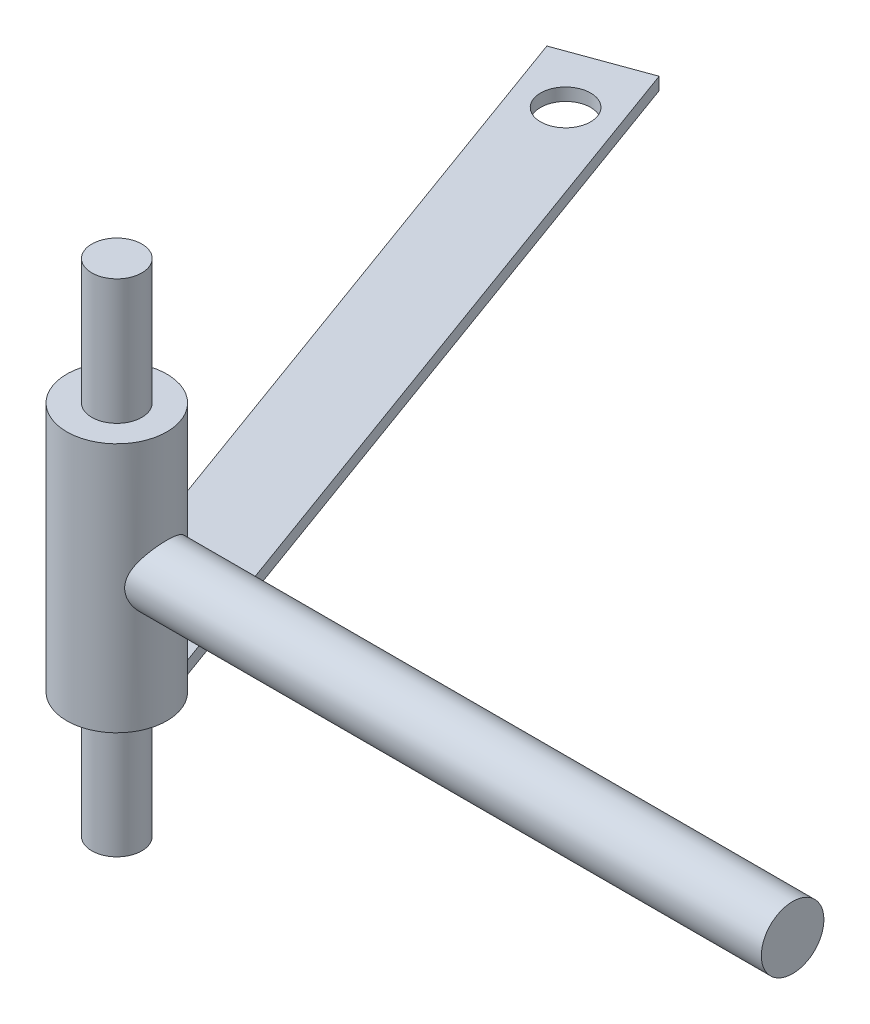
ISO-10303-21;
HEADER;
FILE_DESCRIPTION(('STEP AP214'),'2;1');
FILE_NAME('part.step','',(''),(''),'','','');
FILE_SCHEMA(('AUTOMOTIVE_DESIGN { 1 0 10303 214 1 1 1 1 }'));
ENDSEC;
DATA;
#1=APPLICATION_CONTEXT('core data for automotive mechanical design processes');
#2=APPLICATION_PROTOCOL_DEFINITION('international standard','automotive_design',2000,#1);
#3=PRODUCT_CONTEXT('',#1,'mechanical');
#4=PRODUCT('Part','Part','',(#3));
#5=PRODUCT_RELATED_PRODUCT_CATEGORY('part','',(#4));
#6=PRODUCT_DEFINITION_FORMATION('','',#4);
#7=PRODUCT_DEFINITION_CONTEXT('part definition',#1,'design');
#8=PRODUCT_DEFINITION('design','',#6,#7);
#9=PRODUCT_DEFINITION_SHAPE('','',#8);
#10=(LENGTH_UNIT() NAMED_UNIT(*) SI_UNIT(.MILLI.,.METRE.));
#11=(NAMED_UNIT(*) PLANE_ANGLE_UNIT() SI_UNIT($,.RADIAN.));
#12=(NAMED_UNIT(*) SI_UNIT($,.STERADIAN.) SOLID_ANGLE_UNIT());
#13=UNCERTAINTY_MEASURE_WITH_UNIT(LENGTH_MEASURE(1.E-05),#10,'distance_accuracy_value','');
#14=(GEOMETRIC_REPRESENTATION_CONTEXT(3) GLOBAL_UNCERTAINTY_ASSIGNED_CONTEXT((#13)) GLOBAL_UNIT_ASSIGNED_CONTEXT((#10,
#11,#12)) REPRESENTATION_CONTEXT('',''));
#15=CARTESIAN_POINT('',(0.,0.,0.));
#16=DIRECTION('',(0.,0.,1.));
#17=DIRECTION('',(1.,0.,0.));
#18=AXIS2_PLACEMENT_3D('',#15,#16,#17);
#19=CARTESIAN_POINT('',(0.,20.,0.));
#20=DIRECTION('',(0.,-1.,0.));
#21=DIRECTION('',(0.,0.,-1.));
#22=AXIS2_PLACEMENT_3D('',#19,#20,#21);
#23=CYLINDRICAL_SURFACE('',#22,8.);
#24=CARTESIAN_POINT('',(0.,-18.,0.));
#25=DIRECTION('',(0.,-1.,0.));
#26=DIRECTION('',(0.,0.,-1.));
#27=AXIS2_PLACEMENT_3D('',#24,#25,#26);
#28=CIRCLE('',#27,8.);
#29=CARTESIAN_POINT('',(-7.90248666466915,-18.,-1.24527286757814));
#30=VERTEX_POINT('',#29);
#31=CARTESIAN_POINT('',(5.25321002633356,-18.,-6.03355487413751));
#32=VERTEX_POINT('',#31);
#33=EDGE_CURVE('E52',#30,#32,#28,.T.);
#34=ORIENTED_EDGE('',*,*,#33,.T.);
#35=DIRECTION('',(0.,-1.,0.));
#36=VECTOR('',#35,1.);
#37=CARTESIAN_POINT('',(5.25321002633356,20.,-6.03355487413751));
#38=LINE('',#37,#36);
#39=CARTESIAN_POINT('',(5.25321002633356,-16.,-6.03355487413751));
#40=VERTEX_POINT('',#39);
#41=EDGE_CURVE('E11',#32,#40,#38,.F.);
#42=ORIENTED_EDGE('',*,*,#41,.T.);
#43=CARTESIAN_POINT('',(0.,-16.,0.));
#44=DIRECTION('',(0.,1.,0.));
#45=DIRECTION('',(-1.,0.,0.));
#46=AXIS2_PLACEMENT_3D('',#43,#44,#45);
#47=CIRCLE('',#46,8.);
#48=CARTESIAN_POINT('',(-7.90248666466915,-16.,-1.24527286757812));
#49=VERTEX_POINT('',#48);
#50=EDGE_CURVE('E86',#40,#49,#47,.T.);
#51=ORIENTED_EDGE('',*,*,#50,.T.);
#52=DIRECTION('',(0.,-1.,0.));
#53=VECTOR('',#52,1.);
#54=CARTESIAN_POINT('',(-7.90248666466915,20.,-1.24527286757812));
#55=LINE('',#54,#53);
#56=EDGE_CURVE('E204',#49,#30,#55,.T.);
#57=ORIENTED_EDGE('',*,*,#56,.T.);
#58=EDGE_LOOP('',(#34,#42,#51,#57));
#59=FACE_BOUND('',#58,.T.);
#60=CARTESIAN_POINT('',(0.,20.,0.));
#61=DIRECTION('',(0.,1.,0.));
#62=DIRECTION('',(0.,0.,1.));
#63=AXIS2_PLACEMENT_3D('',#60,#61,#62);
#64=CIRCLE('',#63,8.);
#65=CARTESIAN_POINT('',(0.,20.,8.));
#66=VERTEX_POINT('',#65);
#67=EDGE_CURVE('E130',#66,#66,#64,.T.);
#68=ORIENTED_EDGE('',*,*,#67,.F.);
#69=EDGE_LOOP('',(#68));
#70=FACE_BOUND('',#69,.T.);
#71=CARTESIAN_POINT('',(0.,-20.,0.));
#72=DIRECTION('',(0.,1.,0.));
#73=DIRECTION('',(0.,0.,1.));
#74=AXIS2_PLACEMENT_3D('',#71,#72,#73);
#75=CIRCLE('',#74,8.);
#76=CARTESIAN_POINT('',(0.,-20.,8.));
#77=VERTEX_POINT('',#76);
#78=EDGE_CURVE('E129',#77,#77,#75,.T.);
#79=ORIENTED_EDGE('',*,*,#78,.T.);
#80=EDGE_LOOP('',(#79));
#81=FACE_BOUND('',#80,.T.);
#82=CARTESIAN_POINT('',(6.2449979983984,0.,5.));
#83=CARTESIAN_POINT('',(6.24499999083318,-0.124309997084916,4.99999874728376));
#84=CARTESIAN_POINT('',(6.24872594235153,-0.248643911922182,4.99535477639502));
#85=CARTESIAN_POINT('',(6.26346233698878,-0.49624234521784,4.97686385741702));
#86=CARTESIAN_POINT('',(6.27447707053879,-0.619506190474289,4.96301148892208));
#87=CARTESIAN_POINT('',(6.30332817855701,-0.864132894108489,4.92631685582622));
#88=CARTESIAN_POINT('',(6.32117831167981,-0.985491401070756,4.90345645667282));
#89=CARTESIAN_POINT('',(6.36295500797281,-1.22521846002732,4.84912073775945));
#90=CARTESIAN_POINT('',(6.38688460836052,-1.34358548492504,4.81764111134031));
#91=CARTESIAN_POINT('',(6.46598710467671,-1.69098285176997,4.7115563432738));
#92=CARTESIAN_POINT('',(6.52878844336903,-1.91472159134201,4.6249307188155));
#93=CARTESIAN_POINT('',(6.66732308206754,-2.34407629105235,4.42286683667302));
#94=CARTESIAN_POINT('',(6.74305673480881,-2.54969175663766,4.30742779304936));
#95=CARTESIAN_POINT('',(6.91118002626909,-2.9674414130167,4.03296948836377));
#96=CARTESIAN_POINT('',(7.00444112628932,-3.17674952950574,3.87018134056582));
#97=CARTESIAN_POINT('',(7.19012524520994,-3.5675602565304,3.51319765959103));
#98=CARTESIAN_POINT('',(7.28254746874407,-3.74903864049325,3.31897506071619));
#99=CARTESIAN_POINT('',(7.41988971846401,-4.00760626149244,2.99356128179164));
#100=CARTESIAN_POINT('',(7.46785190700925,-4.09554829341698,2.87212880091628));
#101=CARTESIAN_POINT('',(7.55971876275306,-4.2607595171728,2.62078661715024));
#102=CARTESIAN_POINT('',(7.60362512973126,-4.33803318685166,2.49088050482952));
#103=CARTESIAN_POINT('',(7.68611478127736,-4.48104536831486,2.22333771815377));
#104=CARTESIAN_POINT('',(7.72470066932016,-4.54678952615798,2.08570487145723));
#105=CARTESIAN_POINT('',(7.79539753077303,-4.66588913640084,1.80358193532003));
#106=CARTESIAN_POINT('',(7.82750968154027,-4.71924684175159,1.6590930986712));
#107=CARTESIAN_POINT('',(7.88132879110577,-4.8079574186921,1.37943032429723));
#108=CARTESIAN_POINT('',(7.90376135583819,-4.84458864196752,1.24480106420069));
#109=CARTESIAN_POINT('',(7.94191844310852,-4.90659427549434,0.972050692903698));
#110=CARTESIAN_POINT('',(7.95764407963578,-4.93197055516711,0.833930165626438));
#111=CARTESIAN_POINT('',(7.98191012055643,-4.97102838824165,0.555534462309618));
#112=CARTESIAN_POINT('',(7.9904564434862,-4.98471957483722,0.415261158337185));
#113=CARTESIAN_POINT('',(8.00011955525847,-5.00019508535282,0.133810084943768));
#114=CARTESIAN_POINT('',(8.00123719925945,-5.00198077978344,-0.00736757849820934));
#115=CARTESIAN_POINT('',(7.99636544353032,-4.99418306842006,-0.270239609899376));
#116=CARTESIAN_POINT('',(7.99131217584322,-4.9860972278415,-0.391999310072934));
#117=CARTESIAN_POINT('',(7.97573898833036,-4.96109950689231,-0.63429359230614));
#118=CARTESIAN_POINT('',(7.96521743178982,-4.94418498400023,-0.754827796543429));
#119=CARTESIAN_POINT('',(7.93894787928476,-4.90175195667388,-0.9937504162903));
#120=CARTESIAN_POINT('',(7.92320165200919,-4.8762363638823,-1.11213954368103));
#121=CARTESIAN_POINT('',(7.88683283084566,-4.81691536004192,-1.34607315554106));
#122=CARTESIAN_POINT('',(7.86620835217571,-4.78310674467799,-1.46161652141072));
#123=CARTESIAN_POINT('',(7.79753837345255,-4.66961406787293,-1.80341623892686));
#124=CARTESIAN_POINT('',(7.74273886956257,-4.57793007291278,-2.02447250488061));
#125=CARTESIAN_POINT('',(7.6194209119633,-4.36611560771666,-2.44811588786114));
#126=CARTESIAN_POINT('',(7.55089933332867,-4.24597865675437,-2.6506987826293));
#127=CARTESIAN_POINT('',(7.39573414184525,-3.96389668023518,-3.05883635403528));
#128=CARTESIAN_POINT('',(7.30789649394851,-3.79860933546551,-3.26162345770391));
#129=CARTESIAN_POINT('',(7.12780216070677,-3.43944259665051,-3.63842034253163));
#130=CARTESIAN_POINT('',(7.0355391870356,-3.24552165003414,-3.81238750882611));
#131=CARTESIAN_POINT('',(6.89398778931581,-2.92199806035766,-4.05999923159469));
#132=CARTESIAN_POINT('',(6.84343529038729,-2.80103153254676,-4.14440430037547));
#133=CARTESIAN_POINT('',(6.7450499014227,-2.5512511400869,-4.30267035241461));
#134=CARTESIAN_POINT('',(6.69721752335299,-2.42243580756731,-4.37652935467605));
#135=CARTESIAN_POINT('',(6.60608014442446,-2.15770926568204,-4.51291782494085));
#136=CARTESIAN_POINT('',(6.56276754252838,-2.02181056536115,-4.57546644816391));
#137=CARTESIAN_POINT('',(6.48238923774268,-1.74330768244433,-4.6886516739402));
#138=CARTESIAN_POINT('',(6.44532349757936,-1.60070353986484,-4.7392883475702));
#139=CARTESIAN_POINT('',(6.3879911088914,-1.34808415551627,-4.81614194168603));
#140=CARTESIAN_POINT('',(6.36587062744548,-1.23937010533179,-4.84527833481626));
#141=CARTESIAN_POINT('',(6.3267200135842,-1.01935900201234,-4.89628944573215));
#142=CARTESIAN_POINT('',(6.30968872571675,-0.908062541381968,-4.91816581196151));
#143=CARTESIAN_POINT('',(6.2813224765214,-0.683654493148006,-4.95434333722363));
#144=CARTESIAN_POINT('',(6.26998098512218,-0.570545140796211,-4.96865318123363));
#145=CARTESIAN_POINT('',(6.25339132178237,-0.343158274667134,-4.98951663397229));
#146=CARTESIAN_POINT('',(6.24814339794355,-0.228880713516906,-4.99606992689043));
#147=CARTESIAN_POINT('',(6.24394563972607,0.000213756327469843,-5.00131530513999));
#148=CARTESIAN_POINT('',(6.2450091194138,0.115031294285455,-4.99999077198392));
#149=CARTESIAN_POINT('',(6.25342323341975,0.34411058983996,-4.98946310366481));
#150=CARTESIAN_POINT('',(6.26077617711313,0.458372127783275,-4.98025707456074));
#151=CARTESIAN_POINT('',(6.28148941326477,0.685492435641885,-4.95410620951325));
#152=CARTESIAN_POINT('',(6.29485173090555,0.798350719467862,-4.9371587646522));
#153=CARTESIAN_POINT('',(6.32708655414446,1.02190368194708,-4.8957794498311));
#154=CARTESIAN_POINT('',(6.3459613393153,1.13259744525952,-4.87134448334739));
#155=CARTESIAN_POINT('',(6.40919739263554,1.45674114316006,-4.78821642821574));
#156=CARTESIAN_POINT('',(6.46057720915498,1.6662777271024,-4.71921780239627));
#157=CARTESIAN_POINT('',(6.57662484324882,2.07118631830434,-4.55609149726001));
#158=CARTESIAN_POINT('',(6.6412973751829,2.26655326684989,-4.46195489902188));
#159=CARTESIAN_POINT('',(6.79148506979738,2.67720575477837,-4.23062377482239));
#160=CARTESIAN_POINT('',(6.87862419429458,2.88920195195314,-4.08864375810928));
#161=CARTESIAN_POINT('',(7.05576916354209,3.28876845285956,-3.77473221644168));
#162=CARTESIAN_POINT('',(7.14577790264,3.47631305761312,-3.60276961587649));
#163=CARTESIAN_POINT('',(7.28444679190235,3.75109437385404,-3.30924585333197));
#164=CARTESIAN_POINT('',(7.3346230901993,3.84742308399405,-3.19677534649598));
#165=CARTESIAN_POINT('',(7.43214539316412,4.03023211498251,-2.96297696798608));
#166=CARTESIAN_POINT('',(7.47949245970999,4.11671614194503,-2.84165245789285));
#167=CARTESIAN_POINT('',(7.57009743381039,4.27912544276188,-2.59064393379972));
#168=CARTESIAN_POINT('',(7.61335451021155,4.35504857193848,-2.46095822963468));
#169=CARTESIAN_POINT('',(7.69452475176042,4.49544110368957,-2.19402109584822));
#170=CARTESIAN_POINT('',(7.73244126265916,4.55991768393769,-2.05677447863483));
#171=CARTESIAN_POINT('',(7.79976180045409,4.67313922374355,-1.78389488579443));
#172=CARTESIAN_POINT('',(7.82953658856128,4.72258893611767,-1.64864631402092));
#173=CARTESIAN_POINT('',(7.88249738910155,4.80988250173737,-1.37327166975237));
#174=CARTESIAN_POINT('',(7.90568721484267,4.84773307297854,-1.2331484731144));
#175=CARTESIAN_POINT('',(7.94476970960063,4.91121075887916,-0.949284871547718));
#176=CARTESIAN_POINT('',(7.96066874338032,4.93684853590452,-0.805547737630325));
#177=CARTESIAN_POINT('',(7.98468098207153,4.97547600812264,-0.515747890604359));
#178=CARTESIAN_POINT('',(7.99279547496114,4.98846779564148,-0.369685566273095));
#179=CARTESIAN_POINT('',(8.00036899836203,5.0005918204771,-0.0984542398463481));
#180=CARTESIAN_POINT('',(8.00093085905799,5.00148999709849,0.0266091901107878));
#181=CARTESIAN_POINT('',(7.99619997327325,4.99391869226614,0.276384426548502));
#182=CARTESIAN_POINT('',(7.99090543949389,4.98544635104714,0.401096114033592));
#183=CARTESIAN_POINT('',(7.97459103015405,4.95925462589747,0.649105048465708));
#184=CARTESIAN_POINT('',(7.96357367253312,4.9415393086947,0.772402893113274));
#185=CARTESIAN_POINT('',(7.93607401526798,4.89709863543925,1.01678782002796));
#186=CARTESIAN_POINT('',(7.91958960822669,4.87036980485838,1.13787403075122));
#187=CARTESIAN_POINT('',(7.88220417715129,4.80933512611737,1.3727696067634));
#188=CARTESIAN_POINT('',(7.86147899328625,4.77532902296419,1.486685097437));
#189=CARTESIAN_POINT('',(7.8157172820285,4.69961071566991,1.71105112688166));
#190=CARTESIAN_POINT('',(7.79067928081094,4.65789587685613,1.82150046585626));
#191=CARTESIAN_POINT('',(7.70981708144695,4.52179700785277,2.14674322952902));
#192=CARTESIAN_POINT('',(7.64821482975006,4.41641101660221,2.3556119089249));
#193=CARTESIAN_POINT('',(7.50700801995937,4.1673460340312,2.77466231937412));
#194=CARTESIAN_POINT('',(7.42619858107808,4.02082779517783,2.98273013480178));
#195=CARTESIAN_POINT('',(7.2573471375721,3.6996977630728,3.37285679634255));
#196=CARTESIAN_POINT('',(7.16929702745266,3.52505426989102,3.55488585185797));
#197=CARTESIAN_POINT('',(6.98001614835192,3.12352869133323,3.91489797533942));
#198=CARTESIAN_POINT('',(6.87871489286988,2.89274538552561,4.08851588919805));
#199=CARTESIAN_POINT('',(6.68699282488335,2.40144255795418,4.3950903074783));
#200=CARTESIAN_POINT('',(6.59656601160477,2.14093959230367,4.52806930044201));
#201=CARTESIAN_POINT('',(6.45719150743099,1.65432760274299,4.72397005512007));
#202=CARTESIAN_POINT('',(6.40349524541685,1.43325185965496,4.79586701428079));
#203=CARTESIAN_POINT('',(6.33898756748728,1.09324362690463,4.88041603953431));
#204=CARTESIAN_POINT('',(6.32016868842665,0.978627920072953,4.90470355408434));
#205=CARTESIAN_POINT('',(6.28849738412123,0.747193668970045,4.94524770814465));
#206=CARTESIAN_POINT('',(6.27564188891545,0.630376290428755,4.9615084801139));
#207=CARTESIAN_POINT('',(6.25906589814134,0.427895086979101,4.9823903295282));
#208=CARTESIAN_POINT('',(6.25380210027526,0.342553322442731,4.98898701036639));
#209=CARTESIAN_POINT('',(6.24676702410079,0.171478227136942,4.99779282932784));
#210=CARTESIAN_POINT('',(6.24499662408473,0.0857448033275004,5.00000086408101));
#211=CARTESIAN_POINT('',(6.2449979983984,0.,5.));
#212=B_SPLINE_CURVE_WITH_KNOTS('',3,(#82,#83,#84,#85,#86,#87,#88,#89,#90,#91,#92,#93,#94,#95,
#96,#97,#98,#99,#100,#101,#102,#103,#104,#105,#106,#107,#108,#109,#110,#111,#112,#113,#114,#115,
#116,#117,#118,#119,#120,#121,#122,#123,#124,#125,#126,#127,#128,#129,#130,#131,#132,#133,#134,
#135,#136,#137,#138,#139,#140,#141,#142,#143,#144,#145,#146,#147,#148,#149,#150,#151,#152,#153,
#154,#155,#156,#157,#158,#159,#160,#161,#162,#163,#164,#165,#166,#167,#168,#169,#170,#171,#172,
#173,#174,#175,#176,#177,#178,#179,#180,#181,#182,#183,#184,#185,#186,#187,#188,#189,#190,#191,
#192,#193,#194,#195,#196,#197,#198,#199,#200,#201,#202,#203,#204,#205,#206,#207,#208,#209,#210,
#211),.UNSPECIFIED.,.T.,.F.,(4,2,2,2,2,2,2,2,2,2,2,2,2,2,2,2,2,2,2,2,2,2,2,2,2,2,2,2,2,2,2,2,2,
2,2,2,2,2,2,2,2,2,2,2,2,2,2,2,2,2,2,2,2,2,2,2,2,2,2,2,2,2,2,2,4),(0.,0.372830631717394,
0.745880919988992,1.11968608457865,1.49367836553752,2.2343739724708,2.97508978546025,
3.81517657771247,4.65599058786117,5.1276972709508,5.59920535801266,6.0704818965238,
6.54167264805615,6.9650003716167,7.38825775501684,7.8111658669397,8.2340252946041,
8.59998197802636,8.96604825916241,9.33199074341863,9.69807484639391,10.4313641163756,
11.1648205684642,11.9895533165928,12.8154948839412,13.2827866246025,13.7501660272479,
14.2167463086997,14.6833238060682,15.0271003394338,15.3707987622619,15.7141018213498,
16.0574188576537,16.4014603870609,16.7456282964257,17.0899122787371,17.4343388350078,
18.1111129623981,18.7881275281776,19.5940378131019,20.4007884080993,20.8693475683427,
21.337729748067,21.8062069071061,22.2743892571628,22.7148894158782,23.1551339612148,
23.5949934439159,24.0347801378503,24.409509228706,24.7843527137741,25.1590314139736,
25.5338547106938,25.8954875601863,26.2572442370256,26.9801965139639,27.7781872367985,
28.5770837508034,29.4911341692987,30.4046778558642,31.1173375632652,31.472952845656,
31.8283848529182,32.0854860972178,32.3426519723746),.UNSPECIFIED.);
#213=CARTESIAN_POINT('',(6.2449979983984,0.,5.));
#214=VERTEX_POINT('',#213);
#215=EDGE_CURVE('E150',#214,#214,#212,.T.);
#216=ORIENTED_EDGE('',*,*,#215,.F.);
#217=EDGE_LOOP('',(#216));
#218=FACE_BOUND('',#217,.T.);
#219=ADVANCED_FACE('F43',(#59,#70,#81,#218),#23,.T.);
#220=CARTESIAN_POINT('',(0.,40.,0.));
#221=DIRECTION('',(0.,-1.,0.));
#222=DIRECTION('',(0.,0.,-1.));
#223=AXIS2_PLACEMENT_3D('',#220,#221,#222);
#224=CYLINDRICAL_SURFACE('',#223,4.);
#225=CARTESIAN_POINT('',(0.,20.,0.));
#226=DIRECTION('',(0.,1.,0.));
#227=DIRECTION('',(0.,0.,1.));
#228=AXIS2_PLACEMENT_3D('',#225,#226,#227);
#229=CIRCLE('',#228,4.);
#230=CARTESIAN_POINT('',(0.,20.,4.));
#231=VERTEX_POINT('',#230);
#232=EDGE_CURVE('E134',#231,#231,#229,.T.);
#233=ORIENTED_EDGE('',*,*,#232,.T.);
#234=EDGE_LOOP('',(#233));
#235=FACE_BOUND('',#234,.T.);
#236=CARTESIAN_POINT('',(0.,40.,0.));
#237=DIRECTION('',(0.,1.,0.));
#238=DIRECTION('',(0.,0.,1.));
#239=AXIS2_PLACEMENT_3D('',#236,#237,#238);
#240=CIRCLE('',#239,4.);
#241=CARTESIAN_POINT('',(0.,40.,4.));
#242=VERTEX_POINT('',#241);
#243=EDGE_CURVE('E138',#242,#242,#240,.T.);
#244=ORIENTED_EDGE('',*,*,#243,.F.);
#245=EDGE_LOOP('',(#244));
#246=FACE_BOUND('',#245,.T.);
#247=ADVANCED_FACE('F45',(#235,#246),#224,.T.);
#248=CARTESIAN_POINT('',(0.,40.,0.));
#249=DIRECTION('',(0.,1.,0.));
#250=DIRECTION('',(0.,0.,1.));
#251=AXIS2_PLACEMENT_3D('',#248,#249,#250);
#252=PLANE('',#251);
#253=ORIENTED_EDGE('',*,*,#243,.T.);
#254=EDGE_LOOP('',(#253));
#255=FACE_BOUND('',#254,.T.);
#256=ADVANCED_FACE('F178',(#255),#252,.T.);
#257=CARTESIAN_POINT('',(0.,20.,0.));
#258=DIRECTION('',(0.,1.,0.));
#259=DIRECTION('',(0.,0.,1.));
#260=AXIS2_PLACEMENT_3D('',#257,#258,#259);
#261=PLANE('',#260);
#262=ORIENTED_EDGE('',*,*,#232,.F.);
#263=EDGE_LOOP('',(#262));
#264=FACE_BOUND('',#263,.T.);
#265=ORIENTED_EDGE('',*,*,#67,.T.);
#266=EDGE_LOOP('',(#265));
#267=FACE_BOUND('',#266,.T.);
#268=ADVANCED_FACE('F175',(#264,#267),#261,.T.);
#269=CARTESIAN_POINT('',(0.,-20.,0.));
#270=DIRECTION('',(0.,1.,0.));
#271=DIRECTION('',(0.,0.,1.));
#272=AXIS2_PLACEMENT_3D('',#269,#270,#271);
#273=PLANE('',#272);
#274=CARTESIAN_POINT('',(0.,-20.,0.));
#275=DIRECTION('',(0.,1.,0.));
#276=DIRECTION('',(0.,0.,1.));
#277=AXIS2_PLACEMENT_3D('',#274,#275,#276);
#278=CIRCLE('',#277,4.);
#279=CARTESIAN_POINT('',(0.,-20.,4.));
#280=VERTEX_POINT('',#279);
#281=EDGE_CURVE('E142',#280,#280,#278,.T.);
#282=ORIENTED_EDGE('',*,*,#281,.T.);
#283=EDGE_LOOP('',(#282));
#284=FACE_BOUND('',#283,.T.);
#285=ORIENTED_EDGE('',*,*,#78,.F.);
#286=EDGE_LOOP('',(#285));
#287=FACE_BOUND('',#286,.T.);
#288=ADVANCED_FACE('F177',(#284,#287),#273,.F.);
#289=CARTESIAN_POINT('',(0.,-40.,0.));
#290=DIRECTION('',(0.,1.,0.));
#291=DIRECTION('',(0.,0.,1.));
#292=AXIS2_PLACEMENT_3D('',#289,#290,#291);
#293=PLANE('',#292);
#294=CARTESIAN_POINT('',(0.,-40.,0.));
#295=DIRECTION('',(0.,1.,0.));
#296=DIRECTION('',(0.,0.,1.));
#297=AXIS2_PLACEMENT_3D('',#294,#295,#296);
#298=CIRCLE('',#297,4.);
#299=CARTESIAN_POINT('',(0.,-40.,4.));
#300=VERTEX_POINT('',#299);
#301=EDGE_CURVE('E143',#300,#300,#298,.T.);
#302=ORIENTED_EDGE('',*,*,#301,.F.);
#303=EDGE_LOOP('',(#302));
#304=FACE_BOUND('',#303,.T.);
#305=ADVANCED_FACE('F181',(#304),#293,.F.);
#306=ORIENTED_EDGE('',*,*,#301,.T.);
#307=EDGE_LOOP('',(#306));
#308=FACE_BOUND('',#307,.T.);
#309=ORIENTED_EDGE('',*,*,#281,.F.);
#310=EDGE_LOOP('',(#309));
#311=FACE_BOUND('',#310,.T.);
#312=ADVANCED_FACE('F172',(#308,#311),#224,.T.);
#313=CARTESIAN_POINT('',(108.,0.,0.));
#314=DIRECTION('',(-1.,0.,0.));
#315=DIRECTION('',(0.,0.,1.));
#316=AXIS2_PLACEMENT_3D('',#313,#314,#315);
#317=CYLINDRICAL_SURFACE('',#316,5.);
#318=CARTESIAN_POINT('',(108.,0.,0.));
#319=DIRECTION('',(1.,0.,0.));
#320=DIRECTION('',(0.,0.,-1.));
#321=AXIS2_PLACEMENT_3D('',#318,#319,#320);
#322=CIRCLE('',#321,5.);
#323=CARTESIAN_POINT('',(108.,0.,-5.));
#324=VERTEX_POINT('',#323);
#325=EDGE_CURVE('E119',#324,#324,#322,.T.);
#326=ORIENTED_EDGE('',*,*,#325,.F.);
#327=EDGE_LOOP('',(#326));
#328=FACE_BOUND('',#327,.T.);
#329=ORIENTED_EDGE('',*,*,#215,.T.);
#330=EDGE_LOOP('',(#329));
#331=FACE_BOUND('',#330,.T.);
#332=ADVANCED_FACE('F166',(#328,#331),#317,.T.);
#333=CARTESIAN_POINT('',(108.,0.,0.));
#334=DIRECTION('',(1.,0.,0.));
#335=DIRECTION('',(0.,0.,-1.));
#336=AXIS2_PLACEMENT_3D('',#333,#334,#335);
#337=PLANE('',#336);
#338=ORIENTED_EDGE('',*,*,#325,.T.);
#339=EDGE_LOOP('',(#338));
#340=FACE_BOUND('',#339,.T.);
#341=ADVANCED_FACE('F171',(#340),#337,.T.);
#342=CARTESIAN_POINT('',(-37.8847702868357,-16.,-124.554181705448));
#343=DIRECTION('',(0.939692620785908,0.,-0.342020143325669));
#344=DIRECTION('',(-0.342020143325669,0.,-0.939692620785908));
#345=AXIS2_PLACEMENT_3D('',#342,#343,#344);
#346=PLANE('',#345);
#347=ORIENTED_EDGE('',*,*,#41,.F.);
#348=DIRECTION('',(0.342020143325669,0.,0.939692620785908));
#349=VECTOR('',#348,1.);
#350=CARTESIAN_POINT('',(-37.8847702868357,-18.,-124.554181705448));
#351=LINE('',#350,#349);
#352=CARTESIAN_POINT('',(-37.8847702868357,-18.,-124.554181705448));
#353=VERTEX_POINT('',#352);
#354=EDGE_CURVE('E103',#353,#32,#351,.T.);
#355=ORIENTED_EDGE('',*,*,#354,.F.);
#356=DIRECTION('',(0.,1.,0.));
#357=VECTOR('',#356,1.);
#358=CARTESIAN_POINT('',(-37.8847702868357,-16.,-124.554181705448));
#359=LINE('',#358,#357);
#360=CARTESIAN_POINT('',(-37.8847702868357,-16.,-124.554181705448));
#361=VERTEX_POINT('',#360);
#362=EDGE_CURVE('E96',#353,#361,#359,.T.);
#363=ORIENTED_EDGE('',*,*,#362,.T.);
#364=DIRECTION('',(0.342020143325669,0.,0.939692620785908));
#365=VECTOR('',#364,1.);
#366=CARTESIAN_POINT('',(-37.8847702868357,-16.,-124.554181705448));
#367=LINE('',#366,#365);
#368=EDGE_CURVE('E81',#361,#40,#367,.T.);
#369=ORIENTED_EDGE('',*,*,#368,.T.);
#370=EDGE_LOOP('',(#347,#355,#363,#369));
#371=FACE_BOUND('',#370,.T.);
#372=ADVANCED_FACE('F102',(#371),#346,.T.);
#373=CARTESIAN_POINT('',(-51.0404669778384,-16.,-119.765899698888));
#374=DIRECTION('',(-0.939692620785908,0.,0.342020143325669));
#375=DIRECTION('',(0.342020143325669,0.,0.939692620785908));
#376=AXIS2_PLACEMENT_3D('',#373,#374,#375);
#377=PLANE('',#376);
#378=ORIENTED_EDGE('',*,*,#56,.F.);
#379=DIRECTION('',(0.342020143325669,0.,0.939692620785908));
#380=VECTOR('',#379,1.);
#381=CARTESIAN_POINT('',(-51.0404669778384,-16.,-119.765899698888));
#382=LINE('',#381,#380);
#383=CARTESIAN_POINT('',(-51.0404669778384,-16.,-119.765899698888));
#384=VERTEX_POINT('',#383);
#385=EDGE_CURVE('E59',#384,#49,#382,.T.);
#386=ORIENTED_EDGE('',*,*,#385,.F.);
#387=DIRECTION('',(0.,-1.,0.));
#388=VECTOR('',#387,1.);
#389=CARTESIAN_POINT('',(-51.0404669778384,-16.,-119.765899698888));
#390=LINE('',#389,#388);
#391=CARTESIAN_POINT('',(-51.0404669778384,-18.,-119.765899698888));
#392=VERTEX_POINT('',#391);
#393=EDGE_CURVE('E99',#384,#392,#390,.T.);
#394=ORIENTED_EDGE('',*,*,#393,.T.);
#395=DIRECTION('',(0.342020143325669,0.,0.939692620785908));
#396=VECTOR('',#395,1.);
#397=CARTESIAN_POINT('',(-51.0404669778384,-18.,-119.765899698888));
#398=LINE('',#397,#396);
#399=EDGE_CURVE('E120',#392,#30,#398,.T.);
#400=ORIENTED_EDGE('',*,*,#399,.T.);
#401=EDGE_LOOP('',(#378,#386,#394,#400));
#402=FACE_BOUND('',#401,.T.);
#403=ADVANCED_FACE('F211',(#402),#377,.T.);
#404=CARTESIAN_POINT('',(-51.0404669778384,-18.,-119.765899698888));
#405=DIRECTION('',(0.,-1.,0.));
#406=DIRECTION('',(0.,0.,-1.));
#407=AXIS2_PLACEMENT_3D('',#404,#405,#406);
#408=PLANE('',#407);
#409=CARTESIAN_POINT('',(-41.0424171990803,-18.,-112.763114494309));
#410=DIRECTION('',(0.,-1.,0.));
#411=DIRECTION('',(0.,0.,-1.));
#412=AXIS2_PLACEMENT_3D('',#409,#410,#411);
#413=CIRCLE('',#412,4.00000000000001);
#414=CARTESIAN_POINT('',(-41.0424171990803,-18.,-116.763114494309));
#415=VERTEX_POINT('',#414);
#416=EDGE_CURVE('E109',#415,#415,#413,.F.);
#417=ORIENTED_EDGE('',*,*,#416,.T.);
#418=EDGE_LOOP('',(#417));
#419=FACE_BOUND('',#418,.T.);
#420=ORIENTED_EDGE('',*,*,#33,.F.);
#421=ORIENTED_EDGE('',*,*,#399,.F.);
#422=DIRECTION('',(0.939692620785908,0.,-0.342020143325669));
#423=VECTOR('',#422,1.);
#424=CARTESIAN_POINT('',(-51.0404669778384,-18.,-119.765899698888));
#425=LINE('',#424,#423);
#426=EDGE_CURVE('E89',#392,#353,#425,.T.);
#427=ORIENTED_EDGE('',*,*,#426,.T.);
#428=ORIENTED_EDGE('',*,*,#354,.T.);
#429=EDGE_LOOP('',(#420,#421,#427,#428));
#430=FACE_BOUND('',#429,.T.);
#431=ADVANCED_FACE('F209',(#419,#430),#408,.T.);
#432=CARTESIAN_POINT('',(-51.0404669778384,-16.,-119.765899698888));
#433=DIRECTION('',(0.,1.,0.));
#434=DIRECTION('',(-1.,0.,0.));
#435=AXIS2_PLACEMENT_3D('',#432,#433,#434);
#436=PLANE('',#435);
#437=CARTESIAN_POINT('',(-41.0424171990803,-16.,-112.763114494309));
#438=DIRECTION('',(0.,1.,0.));
#439=DIRECTION('',(-1.,0.,0.));
#440=AXIS2_PLACEMENT_3D('',#437,#438,#439);
#441=CIRCLE('',#440,4.00000000000001);
#442=CARTESIAN_POINT('',(-45.0424171990803,-16.,-112.763114494309));
#443=VERTEX_POINT('',#442);
#444=EDGE_CURVE('E105',#443,#443,#441,.T.);
#445=ORIENTED_EDGE('',*,*,#444,.F.);
#446=EDGE_LOOP('',(#445));
#447=FACE_BOUND('',#446,.T.);
#448=ORIENTED_EDGE('',*,*,#50,.F.);
#449=ORIENTED_EDGE('',*,*,#368,.F.);
#450=DIRECTION('',(-0.939692620785908,0.,0.342020143325669));
#451=VECTOR('',#450,1.);
#452=CARTESIAN_POINT('',(-51.0404669778384,-16.,-119.765899698888));
#453=LINE('',#452,#451);
#454=EDGE_CURVE('E84',#361,#384,#453,.T.);
#455=ORIENTED_EDGE('',*,*,#454,.T.);
#456=ORIENTED_EDGE('',*,*,#385,.T.);
#457=EDGE_LOOP('',(#448,#449,#455,#456));
#458=FACE_BOUND('',#457,.T.);
#459=ADVANCED_FACE('F83',(#447,#458),#436,.T.);
#460=CARTESIAN_POINT('',(-44.462618632337,0.,-122.160040702168));
#461=DIRECTION('',(0.342020143325669,0.,0.939692620785908));
#462=DIRECTION('',(0.939692620785908,0.,-0.342020143325669));
#463=AXIS2_PLACEMENT_3D('',#460,#461,#462);
#464=PLANE('',#463);
#465=ORIENTED_EDGE('',*,*,#362,.F.);
#466=ORIENTED_EDGE('',*,*,#426,.F.);
#467=ORIENTED_EDGE('',*,*,#393,.F.);
#468=ORIENTED_EDGE('',*,*,#454,.F.);
#469=EDGE_LOOP('',(#465,#466,#467,#468));
#470=FACE_BOUND('',#469,.T.);
#471=ADVANCED_FACE('F94',(#470),#464,.F.);
#472=CARTESIAN_POINT('',(-41.0424171990803,-40.001,-112.763114494309));
#473=DIRECTION('',(0.,1.,0.));
#474=DIRECTION('',(-1.,0.,0.));
#475=AXIS2_PLACEMENT_3D('',#472,#473,#474);
#476=CYLINDRICAL_SURFACE('',#475,4.00000000000001);
#477=ORIENTED_EDGE('',*,*,#416,.F.);
#478=EDGE_LOOP('',(#477));
#479=FACE_BOUND('',#478,.T.);
#480=ORIENTED_EDGE('',*,*,#444,.T.);
#481=EDGE_LOOP('',(#480));
#482=FACE_BOUND('',#481,.T.);
#483=ADVANCED_FACE('F227',(#479,#482),#476,.F.);
#484=CLOSED_SHELL('',(#219,#247,#256,#268,#288,#305,#312,#332,#341,#372,#403,#431,#459,#471,#483));
#485=MANIFOLD_SOLID_BREP('B2',#484);
#486=ADVANCED_BREP_SHAPE_REPRESENTATION('',(#18,#485),#14);
#487=SHAPE_DEFINITION_REPRESENTATION(#9,#486);
ENDSEC;
END-ISO-10303-21;
